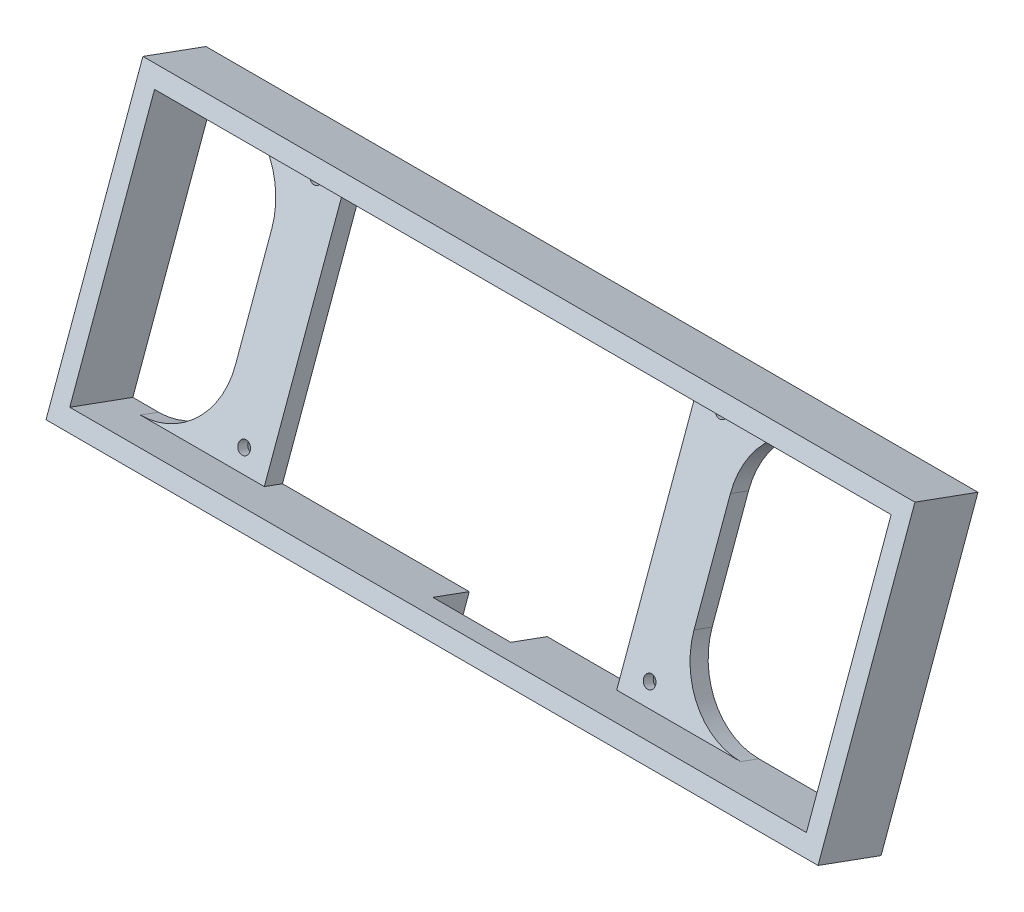
ISO-10303-21;
HEADER;
FILE_DESCRIPTION(('STEP AP214'),'2;1');
FILE_NAME('part.step','',(''),(''),'','','');
FILE_SCHEMA(('AUTOMOTIVE_DESIGN { 1 0 10303 214 1 1 1 1 }'));
ENDSEC;
DATA;
#1=APPLICATION_CONTEXT('core data for automotive mechanical design processes');
#2=APPLICATION_PROTOCOL_DEFINITION('international standard','automotive_design',2000,#1);
#3=PRODUCT_CONTEXT('',#1,'mechanical');
#4=PRODUCT('Part','Part','',(#3));
#5=PRODUCT_RELATED_PRODUCT_CATEGORY('part','',(#4));
#6=PRODUCT_DEFINITION_FORMATION('','',#4);
#7=PRODUCT_DEFINITION_CONTEXT('part definition',#1,'design');
#8=PRODUCT_DEFINITION('design','',#6,#7);
#9=PRODUCT_DEFINITION_SHAPE('','',#8);
#10=(LENGTH_UNIT() NAMED_UNIT(*) SI_UNIT(.MILLI.,.METRE.));
#11=(NAMED_UNIT(*) PLANE_ANGLE_UNIT() SI_UNIT($,.RADIAN.));
#12=(NAMED_UNIT(*) SI_UNIT($,.STERADIAN.) SOLID_ANGLE_UNIT());
#13=UNCERTAINTY_MEASURE_WITH_UNIT(LENGTH_MEASURE(1.E-05),#10,'distance_accuracy_value','');
#14=(GEOMETRIC_REPRESENTATION_CONTEXT(3) GLOBAL_UNCERTAINTY_ASSIGNED_CONTEXT((#13)) GLOBAL_UNIT_ASSIGNED_CONTEXT((#10,
#11,#12)) REPRESENTATION_CONTEXT('',''));
#15=CARTESIAN_POINT('',(0.,0.,0.));
#16=DIRECTION('',(0.,0.,1.));
#17=DIRECTION('',(1.,0.,0.));
#18=AXIS2_PLACEMENT_3D('',#15,#16,#17);
#19=CARTESIAN_POINT('',(-76.75,36.7497554802884,-15.9830526539522));
#20=DIRECTION('',(1.,0.,0.));
#21=DIRECTION('',(0.,0.,-1.));
#22=AXIS2_PLACEMENT_3D('',#19,#20,#21);
#23=PLANE('',#22);
#24=DIRECTION('',(0.,0.939692620785908,-0.342020143325669));
#25=VECTOR('',#24,1.);
#26=CARTESIAN_POINT('',(-76.75,36.7497554802884,-15.9830526539522));
#27=LINE('',#26,#25);
#28=CARTESIAN_POINT('',(-76.75,-14.9333386629365,2.82805522895957));
#29=VERTEX_POINT('',#28);
#30=CARTESIAN_POINT('',(-76.75,13.2574399606407,-7.43254907081052));
#31=VERTEX_POINT('',#30);
#32=EDGE_CURVE('E374',#29,#31,#27,.T.);
#33=ORIENTED_EDGE('',*,*,#32,.F.);
#34=DIRECTION('',(0.,-0.342020143325669,-0.939692620785908));
#35=VECTOR('',#34,1.);
#36=CARTESIAN_POINT('',(-76.75,-14.9333386629365,2.82805522895957));
#37=LINE('',#36,#35);
#38=CARTESIAN_POINT('',(-76.75,-13.0693288818116,7.94938001224278));
#39=VERTEX_POINT('',#38);
#40=EDGE_CURVE('E63',#29,#39,#37,.F.);
#41=ORIENTED_EDGE('',*,*,#40,.T.);
#42=DIRECTION('',(0.,-0.939692620785908,0.342020143325669));
#43=VECTOR('',#42,1.);
#44=CARTESIAN_POINT('',(-76.75,33.9153021574838,-9.15162715404071));
#45=LINE('',#44,#43);
#46=CARTESIAN_POINT('',(-76.75,15.1214497417656,-2.31122428752732));
#47=VERTEX_POINT('',#46);
#48=EDGE_CURVE('E315',#47,#39,#45,.T.);
#49=ORIENTED_EDGE('',*,*,#48,.F.);
#50=DIRECTION('',(0.,-0.342020143325669,-0.939692620785908));
#51=VECTOR('',#50,1.);
#52=CARTESIAN_POINT('',(-76.75,13.2574399606407,-7.43254907081052));
#53=LINE('',#52,#51);
#54=EDGE_CURVE('E55',#47,#31,#53,.T.);
#55=ORIENTED_EDGE('',*,*,#54,.T.);
#56=EDGE_LOOP('',(#33,#41,#49,#55));
#57=FACE_BOUND('',#56,.T.);
#58=ADVANCED_FACE('F40',(#57),#23,.F.);
#59=CARTESIAN_POINT('',(-61.75,36.7497554802884,-15.9830526539522));
#60=DIRECTION('',(-1.,0.,0.));
#61=DIRECTION('',(0.,0.,1.));
#62=AXIS2_PLACEMENT_3D('',#59,#60,#61);
#63=PLANE('',#62);
#64=DIRECTION('',(0.,-0.939692620785908,0.342020143325669));
#65=VECTOR('',#64,1.);
#66=CARTESIAN_POINT('',(-61.75,36.7497554802884,-15.9830526539522));
#67=LINE('',#66,#65);
#68=CARTESIAN_POINT('',(-61.75,32.0512923763589,-14.2729519373239));
#69=VERTEX_POINT('',#68);
#70=CARTESIAN_POINT('',(-61.75,-33.7271910786547,9.66845809547295));
#71=VERTEX_POINT('',#70);
#72=EDGE_CURVE('E371',#69,#71,#67,.T.);
#73=ORIENTED_EDGE('',*,*,#72,.F.);
#74=DIRECTION('',(0.,-0.342020143325669,-0.939692620785908));
#75=VECTOR('',#74,1.);
#76=CARTESIAN_POINT('',(-61.75,33.9153021574838,-9.15162715404071));
#77=LINE('',#76,#75);
#78=CARTESIAN_POINT('',(-61.75,33.9153021574838,-9.15162715404071));
#79=VERTEX_POINT('',#78);
#80=EDGE_CURVE('E282',#79,#69,#77,.T.);
#81=ORIENTED_EDGE('',*,*,#80,.F.);
#82=DIRECTION('',(0.,0.939692620785908,-0.342020143325669));
#83=VECTOR('',#82,1.);
#84=CARTESIAN_POINT('',(-61.75,-31.8631812975298,14.7897828787562));
#85=LINE('',#84,#83);
#86=CARTESIAN_POINT('',(-61.75,-31.8631812975298,14.7897828787562));
#87=VERTEX_POINT('',#86);
#88=EDGE_CURVE('E320',#87,#79,#85,.T.);
#89=ORIENTED_EDGE('',*,*,#88,.F.);
#90=DIRECTION('',(0.,-0.342020143325669,-0.939692620785908));
#91=VECTOR('',#90,1.);
#92=CARTESIAN_POINT('',(-61.75,-31.8631812975298,14.7897828787562));
#93=LINE('',#92,#91);
#94=EDGE_CURVE('E311',#87,#71,#93,.T.);
#95=ORIENTED_EDGE('',*,*,#94,.T.);
#96=EDGE_LOOP('',(#73,#81,#89,#95));
#97=FACE_BOUND('',#96,.T.);
#98=ADVANCED_FACE('F508',(#97),#63,.F.);
#99=CARTESIAN_POINT('',(37.75,36.7497554802884,-15.9830526539522));
#100=DIRECTION('',(1.,0.,0.));
#101=DIRECTION('',(0.,1.,0.));
#102=AXIS2_PLACEMENT_3D('',#99,#100,#101);
#103=PLANE('',#102);
#104=DIRECTION('',(0.,-0.342020143325669,-0.939692620785908));
#105=VECTOR('',#104,1.);
#106=CARTESIAN_POINT('',(37.75,33.9153021574838,-9.15162715404071));
#107=LINE('',#106,#105);
#108=CARTESIAN_POINT('',(37.75,33.9153021574838,-9.15162715404071));
#109=VERTEX_POINT('',#108);
#110=CARTESIAN_POINT('',(37.75,32.0512923763589,-14.2729519373239));
#111=VERTEX_POINT('',#110);
#112=EDGE_CURVE('E307',#109,#111,#107,.T.);
#113=ORIENTED_EDGE('',*,*,#112,.T.);
#114=DIRECTION('',(0.,0.939692620785908,-0.342020143325669));
#115=VECTOR('',#114,1.);
#116=CARTESIAN_POINT('',(37.75,36.7497554802884,-15.9830526539522));
#117=LINE('',#116,#115);
#118=CARTESIAN_POINT('',(37.75,-33.7271910786547,9.66845809547296));
#119=VERTEX_POINT('',#118);
#120=EDGE_CURVE('E354',#119,#111,#117,.T.);
#121=ORIENTED_EDGE('',*,*,#120,.F.);
#122=DIRECTION('',(0.,-0.342020143325669,-0.939692620785908));
#123=VECTOR('',#122,1.);
#124=CARTESIAN_POINT('',(37.75,-31.8631812975298,14.7897828787562));
#125=LINE('',#124,#123);
#126=CARTESIAN_POINT('',(37.75,-31.8631812975298,14.7897828787562));
#127=VERTEX_POINT('',#126);
#128=EDGE_CURVE('E305',#127,#119,#125,.T.);
#129=ORIENTED_EDGE('',*,*,#128,.F.);
#130=DIRECTION('',(0.,-0.939692620785908,0.342020143325669));
#131=VECTOR('',#130,1.);
#132=CARTESIAN_POINT('',(37.75,33.9153021574838,-9.15162715404071));
#133=LINE('',#132,#131);
#134=EDGE_CURVE('E301',#109,#127,#133,.T.);
#135=ORIENTED_EDGE('',*,*,#134,.F.);
#136=EDGE_LOOP('',(#113,#121,#129,#135));
#137=FACE_BOUND('',#136,.T.);
#138=ADVANCED_FACE('F480',(#137),#103,.F.);
#139=CARTESIAN_POINT('',(52.75,36.7497554802884,-15.9830526539522));
#140=DIRECTION('',(-1.,0.,0.));
#141=DIRECTION('',(0.,0.,1.));
#142=AXIS2_PLACEMENT_3D('',#139,#140,#141);
#143=PLANE('',#142);
#144=DIRECTION('',(0.,-0.939692620785908,0.342020143325669));
#145=VECTOR('',#144,1.);
#146=CARTESIAN_POINT('',(52.75,36.7497554802884,-15.9830526539522));
#147=LINE('',#146,#145);
#148=CARTESIAN_POINT('',(52.75,13.2574399606407,-7.43254907081052));
#149=VERTEX_POINT('',#148);
#150=CARTESIAN_POINT('',(52.75,-14.9333386629365,2.82805522895957));
#151=VERTEX_POINT('',#150);
#152=EDGE_CURVE('E362',#149,#151,#147,.T.);
#153=ORIENTED_EDGE('',*,*,#152,.F.);
#154=DIRECTION('',(0.,-0.342020143325669,-0.939692620785908));
#155=VECTOR('',#154,1.);
#156=CARTESIAN_POINT('',(52.75,13.2574399606407,-7.43254907081052));
#157=LINE('',#156,#155);
#158=CARTESIAN_POINT('',(52.75,15.1214497417656,-2.31122428752732));
#159=VERTEX_POINT('',#158);
#160=EDGE_CURVE('E414',#149,#159,#157,.F.);
#161=ORIENTED_EDGE('',*,*,#160,.T.);
#162=DIRECTION('',(0.,0.939692620785908,-0.342020143325669));
#163=VECTOR('',#162,1.);
#164=CARTESIAN_POINT('',(52.75,-31.8631812975298,14.7897828787562));
#165=LINE('',#164,#163);
#166=CARTESIAN_POINT('',(52.75,-13.0693288818116,7.94938001224276));
#167=VERTEX_POINT('',#166);
#168=EDGE_CURVE('E294',#167,#159,#165,.T.);
#169=ORIENTED_EDGE('',*,*,#168,.F.);
#170=DIRECTION('',(0.,-0.342020143325669,-0.939692620785908));
#171=VECTOR('',#170,1.);
#172=CARTESIAN_POINT('',(52.75,-14.9333386629365,2.82805522895957));
#173=LINE('',#172,#171);
#174=EDGE_CURVE('E416',#167,#151,#173,.T.);
#175=ORIENTED_EDGE('',*,*,#174,.T.);
#176=EDGE_LOOP('',(#153,#161,#169,#175));
#177=FACE_BOUND('',#176,.T.);
#178=ADVANCED_FACE('F471',(#177),#143,.F.);
#179=CARTESIAN_POINT('',(13.,-40.6055678757603,-9.22972683707519));
#180=DIRECTION('',(1.,0.,0.));
#181=DIRECTION('',(0.,1.,0.));
#182=AXIS2_PLACEMENT_3D('',#179,#180,#181);
#183=PLANE('',#182);
#184=DIRECTION('',(0.,0.939692620785908,-0.34202014332567));
#185=VECTOR('',#184,1.);
#186=CARTESIAN_POINT('',(13.,-29.9820705092386,19.9580922930787));
#187=LINE('',#186,#185);
#188=CARTESIAN_POINT('',(13.,-34.6805336131681,21.668193009707));
#189=VERTEX_POINT('',#188);
#190=CARTESIAN_POINT('',(13.,-29.9820705092386,19.9580922930787));
#191=VERTEX_POINT('',#190);
#192=EDGE_CURVE('E277',#189,#191,#187,.T.);
#193=ORIENTED_EDGE('',*,*,#192,.T.);
#194=DIRECTION('',(0.,0.342020143325669,0.939692620785908));
#195=VECTOR('',#194,1.);
#196=CARTESIAN_POINT('',(13.,-40.6055678757603,-9.22972683707519));
#197=LINE('',#196,#195);
#198=CARTESIAN_POINT('',(13.,-33.7271910786547,9.66845809547295));
#199=VERTEX_POINT('',#198);
#200=EDGE_CURVE('E336',#199,#191,#197,.T.);
#201=ORIENTED_EDGE('',*,*,#200,.F.);
#202=DIRECTION('',(0.,0.939692620785908,-0.342020143325669));
#203=VECTOR('',#202,1.);
#204=CARTESIAN_POINT('',(13.,-38.4256541825842,11.3785588121013));
#205=LINE('',#204,#203);
#206=CARTESIAN_POINT('',(13.,-38.4256541825842,11.3785588121013));
#207=VERTEX_POINT('',#206);
#208=EDGE_CURVE('E247',#207,#199,#205,.T.);
#209=ORIENTED_EDGE('',*,*,#208,.F.);
#210=DIRECTION('',(0.,0.342020143325669,0.939692620785908));
#211=VECTOR('',#210,1.);
#212=CARTESIAN_POINT('',(13.,-45.3040309796898,-7.51962612044686));
#213=LINE('',#212,#211);
#214=EDGE_CURVE('E339',#207,#189,#213,.T.);
#215=ORIENTED_EDGE('',*,*,#214,.T.);
#216=EDGE_LOOP('',(#193,#201,#209,#215));
#217=FACE_BOUND('',#216,.T.);
#218=ADVANCED_FACE('F597',(#217),#183,.F.);
#219=CARTESIAN_POINT('',(-8.99999999999995,-40.6055678757603,-9.22972683707519));
#220=DIRECTION('',(-1.,0.,0.));
#221=DIRECTION('',(0.,0.,1.));
#222=AXIS2_PLACEMENT_3D('',#219,#220,#221);
#223=PLANE('',#222);
#224=DIRECTION('',(0.,-0.939692620785908,0.34202014332567));
#225=VECTOR('',#224,1.);
#226=CARTESIAN_POINT('',(-8.99999999999995,-29.9820705092386,19.9580922930787));
#227=LINE('',#226,#225);
#228=CARTESIAN_POINT('',(-8.99999999999995,-29.9820705092386,19.9580922930787));
#229=VERTEX_POINT('',#228);
#230=CARTESIAN_POINT('',(-8.99999999999995,-34.6805336131681,21.668193009707));
#231=VERTEX_POINT('',#230);
#232=EDGE_CURVE('E231',#229,#231,#227,.T.);
#233=ORIENTED_EDGE('',*,*,#232,.T.);
#234=DIRECTION('',(0.,0.342020143325669,0.939692620785908));
#235=VECTOR('',#234,1.);
#236=CARTESIAN_POINT('',(-8.99999999999995,-45.3040309796898,-7.51962612044686));
#237=LINE('',#236,#235);
#238=CARTESIAN_POINT('',(-8.99999999999995,-38.4256541825842,11.3785588121013));
#239=VERTEX_POINT('',#238);
#240=EDGE_CURVE('E309',#239,#231,#237,.T.);
#241=ORIENTED_EDGE('',*,*,#240,.F.);
#242=DIRECTION('',(0.,-0.939692620785908,0.342020143325669));
#243=VECTOR('',#242,1.);
#244=CARTESIAN_POINT('',(-8.99999999999998,-33.7271910786547,9.66845809547295));
#245=LINE('',#244,#243);
#246=CARTESIAN_POINT('',(-8.99999999999998,-33.7271910786547,9.66845809547295));
#247=VERTEX_POINT('',#246);
#248=EDGE_CURVE('E246',#247,#239,#245,.T.);
#249=ORIENTED_EDGE('',*,*,#248,.F.);
#250=DIRECTION('',(0.,0.342020143325669,0.939692620785908));
#251=VECTOR('',#250,1.);
#252=CARTESIAN_POINT('',(-8.99999999999995,-40.6055678757603,-9.22972683707519));
#253=LINE('',#252,#251);
#254=EDGE_CURVE('E333',#247,#229,#253,.T.);
#255=ORIENTED_EDGE('',*,*,#254,.T.);
#256=EDGE_LOOP('',(#233,#241,#249,#255));
#257=FACE_BOUND('',#256,.T.);
#258=ADVANCED_FACE('F497',(#257),#223,.F.);
#259=CARTESIAN_POINT('',(-104.,38.5325740923803,3.53422322656905));
#260=DIRECTION('',(0.,-0.939692620785908,0.342020143325669));
#261=DIRECTION('',(0.,-0.342020143325669,-0.939692620785908));
#262=AXIS2_PLACEMENT_3D('',#259,#260,#261);
#263=PLANE('',#262);
#264=DIRECTION('',(-1.,0.,0.));
#265=VECTOR('',#264,1.);
#266=CARTESIAN_POINT('',(52.75,33.9153021574838,-9.15162715404071));
#267=LINE('',#266,#265);
#268=CARTESIAN_POINT('',(72.75,33.9153021574838,-9.15162715404071));
#269=VERTEX_POINT('',#268);
#270=EDGE_CURVE('E299',#269,#109,#267,.T.);
#271=ORIENTED_EDGE('',*,*,#270,.F.);
#272=DIRECTION('',(0.,-0.342020143325669,-0.939692620785908));
#273=VECTOR('',#272,1.);
#274=CARTESIAN_POINT('',(72.75,38.5325740923803,3.53422322656905));
#275=LINE('',#274,#273);
#276=CARTESIAN_POINT('',(72.75,32.0512923763589,-14.2729519373239));
#277=VERTEX_POINT('',#276);
#278=EDGE_CURVE('E424',#269,#277,#275,.T.);
#279=ORIENTED_EDGE('',*,*,#278,.T.);
#280=DIRECTION('',(-1.,0.,0.));
#281=VECTOR('',#280,1.);
#282=CARTESIAN_POINT('',(104.,32.0512923763589,-14.2729519373239));
#283=LINE('',#282,#281);
#284=CARTESIAN_POINT('',(104.,32.0512923763589,-14.2729519373239));
#285=VERTEX_POINT('',#284);
#286=EDGE_CURVE('E224',#285,#277,#283,.T.);
#287=ORIENTED_EDGE('',*,*,#286,.F.);
#288=DIRECTION('',(0.,-0.342020143325669,-0.939692620785908));
#289=VECTOR('',#288,1.);
#290=CARTESIAN_POINT('',(104.,38.5325740923803,3.53422322656905));
#291=LINE('',#290,#289);
#292=CARTESIAN_POINT('',(104.,38.5325740923803,3.53422322656905));
#293=VERTEX_POINT('',#292);
#294=EDGE_CURVE('E395',#293,#285,#291,.T.);
#295=ORIENTED_EDGE('',*,*,#294,.F.);
#296=DIRECTION('',(-1.,0.,0.));
#297=VECTOR('',#296,1.);
#298=CARTESIAN_POINT('',(-104.,38.5325740923803,3.53422322656905));
#299=LINE('',#298,#297);
#300=CARTESIAN_POINT('',(-104.,38.5325740923803,3.53422322656905));
#301=VERTEX_POINT('',#300);
#302=EDGE_CURVE('E388',#293,#301,#299,.T.);
#303=ORIENTED_EDGE('',*,*,#302,.T.);
#304=DIRECTION('',(0.,-0.342020143325669,-0.939692620785908));
#305=VECTOR('',#304,1.);
#306=CARTESIAN_POINT('',(-104.,38.5325740923803,3.53422322656905));
#307=LINE('',#306,#305);
#308=CARTESIAN_POINT('',(-104.,32.0512923763589,-14.2729519373239));
#309=VERTEX_POINT('',#308);
#310=EDGE_CURVE('E213',#301,#309,#307,.T.);
#311=ORIENTED_EDGE('',*,*,#310,.T.);
#312=DIRECTION('',(-1.,0.,0.));
#313=VECTOR('',#312,1.);
#314=CARTESIAN_POINT('',(-96.75,32.0512923763589,-14.2729519373239));
#315=LINE('',#314,#313);
#316=CARTESIAN_POINT('',(-96.75,32.0512923763589,-14.2729519373239));
#317=VERTEX_POINT('',#316);
#318=EDGE_CURVE('E230',#317,#309,#315,.T.);
#319=ORIENTED_EDGE('',*,*,#318,.F.);
#320=DIRECTION('',(0.,-0.342020143325669,-0.939692620785908));
#321=VECTOR('',#320,1.);
#322=CARTESIAN_POINT('',(-96.75,38.5325740923803,3.53422322656905));
#323=LINE('',#322,#321);
#324=CARTESIAN_POINT('',(-96.75,33.9153021574838,-9.15162715404071));
#325=VERTEX_POINT('',#324);
#326=EDGE_CURVE('E421',#317,#325,#323,.F.);
#327=ORIENTED_EDGE('',*,*,#326,.T.);
#328=DIRECTION('',(-1.,0.,0.));
#329=VECTOR('',#328,1.);
#330=CARTESIAN_POINT('',(-61.75,33.9153021574838,-9.15162715404071));
#331=LINE('',#330,#329);
#332=EDGE_CURVE('E318',#79,#325,#331,.T.);
#333=ORIENTED_EDGE('',*,*,#332,.F.);
#334=ORIENTED_EDGE('',*,*,#80,.T.);
#335=DIRECTION('',(-1.,0.,0.));
#336=VECTOR('',#335,1.);
#337=CARTESIAN_POINT('',(37.75,32.0512923763589,-14.2729519373239));
#338=LINE('',#337,#336);
#339=EDGE_CURVE('E250',#111,#69,#338,.T.);
#340=ORIENTED_EDGE('',*,*,#339,.F.);
#341=ORIENTED_EDGE('',*,*,#112,.F.);
#342=EDGE_LOOP('',(#271,#279,#287,#295,#303,#311,#319,#327,#333,#334,#340,#341));
#343=FACE_BOUND('',#342,.T.);
#344=ADVANCED_FACE('F444',(#343),#263,.T.);
#345=CARTESIAN_POINT('',(-104.,-27.2459093626332,27.4756332593659));
#346=DIRECTION('',(0.,0.939692620785908,-0.342020143325669));
#347=DIRECTION('',(0.,0.342020143325669,0.939692620785908));
#348=AXIS2_PLACEMENT_3D('',#345,#346,#347);
#349=PLANE('',#348);
#350=DIRECTION('',(0.,-0.342020143325669,-0.939692620785908));
#351=VECTOR('',#350,1.);
#352=CARTESIAN_POINT('',(104.,-27.2459093626332,27.4756332593659));
#353=LINE('',#352,#351);
#354=CARTESIAN_POINT('',(104.,-27.2459093626332,27.4756332593659));
#355=VERTEX_POINT('',#354);
#356=CARTESIAN_POINT('',(104.,-33.7271910786547,9.66845809547295));
#357=VERTEX_POINT('',#356);
#358=EDGE_CURVE('E214',#355,#357,#353,.T.);
#359=ORIENTED_EDGE('',*,*,#358,.T.);
#360=DIRECTION('',(1.,0.,0.));
#361=VECTOR('',#360,1.);
#362=CARTESIAN_POINT('',(72.75,-33.7271910786547,9.66845809547297));
#363=LINE('',#362,#361);
#364=CARTESIAN_POINT('',(72.75,-33.7271910786547,9.66845809547295));
#365=VERTEX_POINT('',#364);
#366=EDGE_CURVE('E264',#365,#357,#363,.T.);
#367=ORIENTED_EDGE('',*,*,#366,.F.);
#368=DIRECTION('',(0.,-0.342020143325669,-0.939692620785908));
#369=VECTOR('',#368,1.);
#370=CARTESIAN_POINT('',(72.75,-27.2459093626332,27.4756332593659));
#371=LINE('',#370,#369);
#372=CARTESIAN_POINT('',(72.75,-31.8631812975298,14.7897828787562));
#373=VERTEX_POINT('',#372);
#374=EDGE_CURVE('E418',#365,#373,#371,.F.);
#375=ORIENTED_EDGE('',*,*,#374,.T.);
#376=DIRECTION('',(1.,0.,0.));
#377=VECTOR('',#376,1.);
#378=CARTESIAN_POINT('',(37.75,-31.8631812975298,14.7897828787562));
#379=LINE('',#378,#377);
#380=EDGE_CURVE('E303',#127,#373,#379,.T.);
#381=ORIENTED_EDGE('',*,*,#380,.F.);
#382=ORIENTED_EDGE('',*,*,#128,.T.);
#383=DIRECTION('',(1.,0.,0.));
#384=VECTOR('',#383,1.);
#385=CARTESIAN_POINT('',(13.0000000000001,-33.7271910786547,9.66845809547297));
#386=LINE('',#385,#384);
#387=EDGE_CURVE('E243',#199,#119,#386,.T.);
#388=ORIENTED_EDGE('',*,*,#387,.F.);
#389=ORIENTED_EDGE('',*,*,#200,.T.);
#390=DIRECTION('',(-1.,0.,0.));
#391=VECTOR('',#390,1.);
#392=CARTESIAN_POINT('',(-8.99999999999995,-29.9820705092386,19.9580922930787));
#393=LINE('',#392,#391);
#394=EDGE_CURVE('E279',#191,#229,#393,.T.);
#395=ORIENTED_EDGE('',*,*,#394,.T.);
#396=ORIENTED_EDGE('',*,*,#254,.F.);
#397=DIRECTION('',(1.,0.,0.));
#398=VECTOR('',#397,1.);
#399=CARTESIAN_POINT('',(-61.75,-33.7271910786547,9.66845809547297));
#400=LINE('',#399,#398);
#401=EDGE_CURVE('E270',#71,#247,#400,.T.);
#402=ORIENTED_EDGE('',*,*,#401,.F.);
#403=ORIENTED_EDGE('',*,*,#94,.F.);
#404=DIRECTION('',(1.,0.,0.));
#405=VECTOR('',#404,1.);
#406=CARTESIAN_POINT('',(-76.75,-31.8631812975298,14.7897828787562));
#407=LINE('',#406,#405);
#408=CARTESIAN_POINT('',(-96.75,-31.8631812975298,14.7897828787562));
#409=VERTEX_POINT('',#408);
#410=EDGE_CURVE('E313',#409,#87,#407,.T.);
#411=ORIENTED_EDGE('',*,*,#410,.F.);
#412=DIRECTION('',(0.,-0.342020143325669,-0.939692620785908));
#413=VECTOR('',#412,1.);
#414=CARTESIAN_POINT('',(-96.75,-27.2459093626332,27.4756332593659));
#415=LINE('',#414,#413);
#416=CARTESIAN_POINT('',(-96.75,-33.7271910786547,9.66845809547297));
#417=VERTEX_POINT('',#416);
#418=EDGE_CURVE('E220',#409,#417,#415,.T.);
#419=ORIENTED_EDGE('',*,*,#418,.T.);
#420=DIRECTION('',(1.,0.,0.));
#421=VECTOR('',#420,1.);
#422=CARTESIAN_POINT('',(-104.,-33.7271910786547,9.66845809547297));
#423=LINE('',#422,#421);
#424=CARTESIAN_POINT('',(-104.,-33.7271910786547,9.66845809547295));
#425=VERTEX_POINT('',#424);
#426=EDGE_CURVE('E217',#425,#417,#423,.T.);
#427=ORIENTED_EDGE('',*,*,#426,.F.);
#428=DIRECTION('',(0.,-0.342020143325669,-0.939692620785908));
#429=VECTOR('',#428,1.);
#430=CARTESIAN_POINT('',(-104.,-27.2459093626332,27.4756332593659));
#431=LINE('',#430,#429);
#432=CARTESIAN_POINT('',(-104.,-27.2459093626332,27.4756332593659));
#433=VERTEX_POINT('',#432);
#434=EDGE_CURVE('E202',#433,#425,#431,.T.);
#435=ORIENTED_EDGE('',*,*,#434,.F.);
#436=DIRECTION('',(1.,0.,0.));
#437=VECTOR('',#436,1.);
#438=CARTESIAN_POINT('',(-104.,-27.2459093626332,27.4756332593659));
#439=LINE('',#438,#437);
#440=EDGE_CURVE('E391',#433,#355,#439,.T.);
#441=ORIENTED_EDGE('',*,*,#440,.T.);
#442=EDGE_LOOP('',(#359,#367,#375,#381,#382,#388,#389,#395,#396,#402,#403,#411,#419,#427,#435,#441));
#443=FACE_BOUND('',#442,.T.);
#444=ADVANCED_FACE('F218',(#443),#349,.T.);
#445=CARTESIAN_POINT('',(0.,5.64333236487355,15.5049282429675));
#446=DIRECTION('',(0.,0.342020143325669,0.939692620785908));
#447=DIRECTION('',(0.,-0.939692620785908,0.342020143325669));
#448=AXIS2_PLACEMENT_3D('',#445,#446,#447);
#449=PLANE('',#448);
#450=DIRECTION('',(0.,0.939692620785908,-0.34202014332567));
#451=VECTOR('',#450,1.);
#452=CARTESIAN_POINT('',(104.,-27.2459093626332,27.4756332593659));
#453=LINE('',#452,#451);
#454=EDGE_CURVE('E368',#355,#293,#453,.T.);
#455=ORIENTED_EDGE('',*,*,#454,.F.);
#456=ORIENTED_EDGE('',*,*,#440,.F.);
#457=DIRECTION('',(0.,-0.939692620785908,0.34202014332567));
#458=VECTOR('',#457,1.);
#459=CARTESIAN_POINT('',(-104.,-27.2459093626332,27.4756332593659));
#460=LINE('',#459,#458);
#461=EDGE_CURVE('E210',#301,#433,#460,.T.);
#462=ORIENTED_EDGE('',*,*,#461,.F.);
#463=ORIENTED_EDGE('',*,*,#302,.F.);
#464=EDGE_LOOP('',(#455,#456,#462,#463));
#465=FACE_BOUND('',#464,.T.);
#466=DIRECTION('',(1.,0.,0.));
#467=VECTOR('',#466,1.);
#468=CARTESIAN_POINT('',(-109.,-31.9443724665628,29.1857339759943));
#469=LINE('',#468,#467);
#470=CARTESIAN_POINT('',(-109.,-31.9443724665628,29.1857339759943));
#471=VERTEX_POINT('',#470);
#472=CARTESIAN_POINT('',(109.,-31.9443724665628,29.1857339759943));
#473=VERTEX_POINT('',#472);
#474=EDGE_CURVE('E404',#471,#473,#469,.T.);
#475=ORIENTED_EDGE('',*,*,#474,.T.);
#476=DIRECTION('',(0.,0.939692620785908,-0.342020143325669));
#477=VECTOR('',#476,1.);
#478=CARTESIAN_POINT('',(109.,43.2310371963099,1.82412250994071));
#479=LINE('',#478,#477);
#480=CARTESIAN_POINT('',(109.,43.2310371963099,1.82412250994071));
#481=VERTEX_POINT('',#480);
#482=EDGE_CURVE('E397',#473,#481,#479,.T.);
#483=ORIENTED_EDGE('',*,*,#482,.T.);
#484=DIRECTION('',(-1.,0.,0.));
#485=VECTOR('',#484,1.);
#486=CARTESIAN_POINT('',(-109.,43.2310371963099,1.82412250994071));
#487=LINE('',#486,#485);
#488=CARTESIAN_POINT('',(-109.,43.2310371963099,1.82412250994071));
#489=VERTEX_POINT('',#488);
#490=EDGE_CURVE('E400',#481,#489,#487,.T.);
#491=ORIENTED_EDGE('',*,*,#490,.T.);
#492=DIRECTION('',(0.,-0.939692620785908,0.342020143325669));
#493=VECTOR('',#492,1.);
#494=CARTESIAN_POINT('',(-109.,43.2310371963099,1.82412250994071));
#495=LINE('',#494,#493);
#496=EDGE_CURVE('E402',#489,#471,#495,.T.);
#497=ORIENTED_EDGE('',*,*,#496,.T.);
#498=EDGE_LOOP('',(#475,#483,#491,#497));
#499=FACE_BOUND('',#498,.T.);
#500=ADVANCED_FACE('F449',(#465,#499),#449,.T.);
#501=CARTESIAN_POINT('',(109.,43.2310371963099,1.82412250994071));
#502=DIRECTION('',(-1.,0.,0.));
#503=DIRECTION('',(0.,0.,1.));
#504=AXIS2_PLACEMENT_3D('',#501,#502,#503);
#505=PLANE('',#504);
#506=DIRECTION('',(0.,-0.342020143325669,-0.939692620785908));
#507=VECTOR('',#506,1.);
#508=CARTESIAN_POINT('',(109.,-31.9443724665628,29.1857339759943));
#509=LINE('',#508,#507);
#510=CARTESIAN_POINT('',(109.,-38.4256541825842,11.3785588121013));
#511=VERTEX_POINT('',#510);
#512=EDGE_CURVE('E406',#473,#511,#509,.T.);
#513=ORIENTED_EDGE('',*,*,#512,.T.);
#514=DIRECTION('',(0.,-0.939692620785908,0.342020143325669));
#515=VECTOR('',#514,1.);
#516=CARTESIAN_POINT('',(109.,36.7497554802884,-15.9830526539523));
#517=LINE('',#516,#515);
#518=CARTESIAN_POINT('',(109.,36.7497554802884,-15.9830526539523));
#519=VERTEX_POINT('',#518);
#520=EDGE_CURVE('E258',#519,#511,#517,.T.);
#521=ORIENTED_EDGE('',*,*,#520,.F.);
#522=DIRECTION('',(0.,-0.342020143325669,-0.939692620785908));
#523=VECTOR('',#522,1.);
#524=CARTESIAN_POINT('',(109.,43.2310371963099,1.82412250994071));
#525=LINE('',#524,#523);
#526=EDGE_CURVE('E412',#481,#519,#525,.T.);
#527=ORIENTED_EDGE('',*,*,#526,.F.);
#528=ORIENTED_EDGE('',*,*,#482,.F.);
#529=EDGE_LOOP('',(#513,#521,#527,#528));
#530=FACE_BOUND('',#529,.T.);
#531=ADVANCED_FACE('F537',(#530),#505,.F.);
#532=CARTESIAN_POINT('',(-109.,43.2310371963099,1.82412250994071));
#533=DIRECTION('',(0.,-0.939692620785908,0.342020143325669));
#534=DIRECTION('',(0.,-0.342020143325669,-0.939692620785908));
#535=AXIS2_PLACEMENT_3D('',#532,#533,#534);
#536=PLANE('',#535);
#537=DIRECTION('',(1.,0.,0.));
#538=VECTOR('',#537,1.);
#539=CARTESIAN_POINT('',(52.75,36.7497554802884,-15.9830526539522));
#540=LINE('',#539,#538);
#541=CARTESIAN_POINT('',(-109.,36.7497554802884,-15.9830526539523));
#542=VERTEX_POINT('',#541);
#543=EDGE_CURVE('E359',#542,#519,#540,.T.);
#544=ORIENTED_EDGE('',*,*,#543,.F.);
#545=DIRECTION('',(0.,-0.342020143325669,-0.939692620785908));
#546=VECTOR('',#545,1.);
#547=CARTESIAN_POINT('',(-109.,43.2310371963099,1.82412250994071));
#548=LINE('',#547,#546);
#549=EDGE_CURVE('E410',#489,#542,#548,.T.);
#550=ORIENTED_EDGE('',*,*,#549,.F.);
#551=ORIENTED_EDGE('',*,*,#490,.F.);
#552=ORIENTED_EDGE('',*,*,#526,.T.);
#553=EDGE_LOOP('',(#544,#550,#551,#552));
#554=FACE_BOUND('',#553,.T.);
#555=ADVANCED_FACE('F543',(#554),#536,.F.);
#556=CARTESIAN_POINT('',(-109.,43.2310371963099,1.82412250994071));
#557=DIRECTION('',(1.,0.,0.));
#558=DIRECTION('',(0.,0.,-1.));
#559=AXIS2_PLACEMENT_3D('',#556,#557,#558);
#560=PLANE('',#559);
#561=ORIENTED_EDGE('',*,*,#549,.T.);
#562=DIRECTION('',(0.,0.939692620785908,-0.342020143325669));
#563=VECTOR('',#562,1.);
#564=CARTESIAN_POINT('',(-109.,-38.4256541825842,11.3785588121013));
#565=LINE('',#564,#563);
#566=CARTESIAN_POINT('',(-109.,-38.4256541825842,11.3785588121013));
#567=VERTEX_POINT('',#566);
#568=EDGE_CURVE('E239',#567,#542,#565,.T.);
#569=ORIENTED_EDGE('',*,*,#568,.F.);
#570=DIRECTION('',(0.,-0.342020143325669,-0.939692620785908));
#571=VECTOR('',#570,1.);
#572=CARTESIAN_POINT('',(-109.,-31.9443724665628,29.1857339759943));
#573=LINE('',#572,#571);
#574=EDGE_CURVE('E408',#471,#567,#573,.T.);
#575=ORIENTED_EDGE('',*,*,#574,.F.);
#576=ORIENTED_EDGE('',*,*,#496,.F.);
#577=EDGE_LOOP('',(#561,#569,#575,#576));
#578=FACE_BOUND('',#577,.T.);
#579=ADVANCED_FACE('F540',(#578),#560,.F.);
#580=CARTESIAN_POINT('',(-109.,-31.9443724665628,29.1857339759943));
#581=DIRECTION('',(0.,0.939692620785908,-0.342020143325669));
#582=DIRECTION('',(0.,0.342020143325669,0.939692620785908));
#583=AXIS2_PLACEMENT_3D('',#580,#581,#582);
#584=PLANE('',#583);
#585=DIRECTION('',(-1.,0.,0.));
#586=VECTOR('',#585,1.);
#587=CARTESIAN_POINT('',(-61.75,-38.4256541825842,11.3785588121013));
#588=LINE('',#587,#586);
#589=EDGE_CURVE('E335',#239,#567,#588,.T.);
#590=ORIENTED_EDGE('',*,*,#589,.F.);
#591=ORIENTED_EDGE('',*,*,#240,.T.);
#592=DIRECTION('',(1.,0.,0.));
#593=VECTOR('',#592,1.);
#594=CARTESIAN_POINT('',(-8.99999999999995,-34.6805336131681,21.668193009707));
#595=LINE('',#594,#593);
#596=EDGE_CURVE('E233',#231,#189,#595,.T.);
#597=ORIENTED_EDGE('',*,*,#596,.T.);
#598=ORIENTED_EDGE('',*,*,#214,.F.);
#599=DIRECTION('',(-1.,0.,0.));
#600=VECTOR('',#599,1.);
#601=CARTESIAN_POINT('',(52.75,-38.4256541825842,11.3785588121013));
#602=LINE('',#601,#600);
#603=EDGE_CURVE('E365',#511,#207,#602,.T.);
#604=ORIENTED_EDGE('',*,*,#603,.F.);
#605=ORIENTED_EDGE('',*,*,#512,.F.);
#606=ORIENTED_EDGE('',*,*,#474,.F.);
#607=ORIENTED_EDGE('',*,*,#574,.T.);
#608=EDGE_LOOP('',(#590,#591,#597,#598,#604,#605,#606,#607));
#609=FACE_BOUND('',#608,.T.);
#610=ADVANCED_FACE('F501',(#609),#584,.F.);
#611=CARTESIAN_POINT('',(104.,-27.2459093626332,27.4756332593659));
#612=DIRECTION('',(-1.,0.,0.));
#613=DIRECTION('',(0.,0.,1.));
#614=AXIS2_PLACEMENT_3D('',#611,#612,#613);
#615=PLANE('',#614);
#616=ORIENTED_EDGE('',*,*,#294,.T.);
#617=DIRECTION('',(0.,0.939692620785908,-0.342020143325669));
#618=VECTOR('',#617,1.);
#619=CARTESIAN_POINT('',(104.,-33.7271910786547,9.66845809547295));
#620=LINE('',#619,#618);
#621=EDGE_CURVE('E267',#357,#285,#620,.T.);
#622=ORIENTED_EDGE('',*,*,#621,.F.);
#623=ORIENTED_EDGE('',*,*,#358,.F.);
#624=ORIENTED_EDGE('',*,*,#454,.T.);
#625=EDGE_LOOP('',(#616,#622,#623,#624));
#626=FACE_BOUND('',#625,.T.);
#627=ADVANCED_FACE('F455',(#626),#615,.T.);
#628=CARTESIAN_POINT('',(-104.,-27.2459093626332,27.4756332593659));
#629=DIRECTION('',(1.,0.,0.));
#630=DIRECTION('',(0.,0.,-1.));
#631=AXIS2_PLACEMENT_3D('',#628,#629,#630);
#632=PLANE('',#631);
#633=ORIENTED_EDGE('',*,*,#434,.T.);
#634=DIRECTION('',(0.,-0.939692620785908,0.342020143325669));
#635=VECTOR('',#634,1.);
#636=CARTESIAN_POINT('',(-104.,32.0512923763589,-14.2729519373239));
#637=LINE('',#636,#635);
#638=EDGE_CURVE('E207',#309,#425,#637,.T.);
#639=ORIENTED_EDGE('',*,*,#638,.F.);
#640=ORIENTED_EDGE('',*,*,#310,.F.);
#641=ORIENTED_EDGE('',*,*,#461,.T.);
#642=EDGE_LOOP('',(#633,#639,#640,#641));
#643=FACE_BOUND('',#642,.T.);
#644=ADVANCED_FACE('F204',(#643),#632,.T.);
#645=CARTESIAN_POINT('',(-69.25,27.1179061172329,-12.4773461848641));
#646=DIRECTION('',(0.,0.342020143325669,0.939692620785908));
#647=DIRECTION('',(0.,-0.939692620785908,0.342020143325669));
#648=AXIS2_PLACEMENT_3D('',#645,#646,#647);
#649=CYLINDRICAL_SURFACE('',#648,3.25000000000001);
#650=CARTESIAN_POINT('',(-69.25,27.1179061172329,-12.4773461848641));
#651=DIRECTION('',(0.,-0.342020143325669,-0.939692620785908));
#652=DIRECTION('',(0.,0.939692620785908,-0.342020143325669));
#653=AXIS2_PLACEMENT_3D('',#650,#651,#652);
#654=CIRCLE('',#653,3.25000000000001);
#655=CARTESIAN_POINT('',(-69.25,30.1719071347871,-13.5889116506726));
#656=VERTEX_POINT('',#655);
#657=EDGE_CURVE('E376',#656,#656,#654,.T.);
#658=ORIENTED_EDGE('',*,*,#657,.T.);
#659=EDGE_LOOP('',(#658));
#660=FACE_BOUND('',#659,.T.);
#661=CARTESIAN_POINT('',(-69.25,27.9558554683808,-10.1750992639387));
#662=DIRECTION('',(0.,-0.342020143325669,-0.939692620785908));
#663=DIRECTION('',(0.,0.939692620785908,-0.342020143325669));
#664=AXIS2_PLACEMENT_3D('',#661,#662,#663);
#665=CIRCLE('',#664,3.25000000000001);
#666=CARTESIAN_POINT('',(-69.25,31.009856485935,-11.2866647297471));
#667=VERTEX_POINT('',#666);
#668=EDGE_CURVE('E377',#667,#667,#665,.T.);
#669=ORIENTED_EDGE('',*,*,#668,.F.);
#670=EDGE_LOOP('',(#669));
#671=FACE_BOUND('',#670,.T.);
#672=ADVANCED_FACE('F519',(#660,#671),#649,.F.);
#673=CARTESIAN_POINT('',(-69.25,-28.7938048195287,7.87285234301319));
#674=DIRECTION('',(0.,0.342020143325669,0.939692620785908));
#675=DIRECTION('',(0.,-0.939692620785908,0.342020143325669));
#676=AXIS2_PLACEMENT_3D('',#673,#674,#675);
#677=CYLINDRICAL_SURFACE('',#676,3.25000000000001);
#678=CARTESIAN_POINT('',(-69.25,-28.7938048195287,7.87285234301319));
#679=DIRECTION('',(0.,-0.342020143325669,-0.939692620785908));
#680=DIRECTION('',(0.,0.939692620785908,-0.342020143325669));
#681=AXIS2_PLACEMENT_3D('',#678,#679,#680);
#682=CIRCLE('',#681,3.25000000000001);
#683=CARTESIAN_POINT('',(-69.25,-25.7398038019744,6.76128687720476));
#684=VERTEX_POINT('',#683);
#685=EDGE_CURVE('E380',#684,#684,#682,.T.);
#686=ORIENTED_EDGE('',*,*,#685,.T.);
#687=EDGE_LOOP('',(#686));
#688=FACE_BOUND('',#687,.T.);
#689=CARTESIAN_POINT('',(-69.25,-27.9558554683808,10.1750992639387));
#690=DIRECTION('',(0.,-0.342020143325669,-0.939692620785908));
#691=DIRECTION('',(0.,0.939692620785908,-0.342020143325669));
#692=AXIS2_PLACEMENT_3D('',#689,#690,#691);
#693=CIRCLE('',#692,3.25000000000001);
#694=CARTESIAN_POINT('',(-69.25,-24.9018544508266,9.06353379813024));
#695=VERTEX_POINT('',#694);
#696=EDGE_CURVE('E350',#695,#695,#693,.T.);
#697=ORIENTED_EDGE('',*,*,#696,.F.);
#698=EDGE_LOOP('',(#697));
#699=FACE_BOUND('',#698,.T.);
#700=ADVANCED_FACE('F522',(#688,#699),#677,.F.);
#701=CARTESIAN_POINT('',(0.,-0.83794935114789,-2.30224692092547));
#702=DIRECTION('',(0.,-0.342020143325669,-0.939692620785908));
#703=DIRECTION('',(0.,0.939692620785908,-0.342020143325669));
#704=AXIS2_PLACEMENT_3D('',#701,#702,#703);
#705=PLANE('',#704);
#706=CARTESIAN_POINT('',(-96.75,-14.9333386629365,2.82805522895958));
#707=DIRECTION('',(0.,-0.342020143325669,-0.939692620785908));
#708=DIRECTION('',(0.,0.939692620785908,-0.342020143325669));
#709=AXIS2_PLACEMENT_3D('',#706,#707,#708);
#710=CIRCLE('',#709,20.);
#711=EDGE_CURVE('E223',#417,#29,#710,.F.);
#712=ORIENTED_EDGE('',*,*,#711,.T.);
#713=ORIENTED_EDGE('',*,*,#32,.T.);
#714=CARTESIAN_POINT('',(-96.75,13.2574399606407,-7.43254907081051));
#715=DIRECTION('',(0.,-0.342020143325669,-0.939692620785908));
#716=DIRECTION('',(0.,0.939692620785908,-0.342020143325669));
#717=AXIS2_PLACEMENT_3D('',#714,#715,#716);
#718=CIRCLE('',#717,20.);
#719=EDGE_CURVE('E235',#31,#317,#718,.F.);
#720=ORIENTED_EDGE('',*,*,#719,.T.);
#721=ORIENTED_EDGE('',*,*,#318,.T.);
#722=ORIENTED_EDGE('',*,*,#638,.T.);
#723=ORIENTED_EDGE('',*,*,#426,.T.);
#724=EDGE_LOOP('',(#712,#713,#720,#721,#722,#723));
#725=FACE_BOUND('',#724,.T.);
#726=CARTESIAN_POINT('',(72.75,13.2574399606407,-7.43254907081052));
#727=DIRECTION('',(0.,-0.342020143325669,-0.939692620785908));
#728=DIRECTION('',(0.,0.939692620785908,-0.342020143325669));
#729=AXIS2_PLACEMENT_3D('',#726,#727,#728);
#730=CIRCLE('',#729,20.);
#731=EDGE_CURVE('E255',#277,#149,#730,.F.);
#732=ORIENTED_EDGE('',*,*,#731,.T.);
#733=ORIENTED_EDGE('',*,*,#152,.T.);
#734=CARTESIAN_POINT('',(72.75,-14.9333386629365,2.82805522895958));
#735=DIRECTION('',(0.,-0.342020143325669,-0.939692620785908));
#736=DIRECTION('',(0.,0.939692620785908,-0.342020143325669));
#737=AXIS2_PLACEMENT_3D('',#734,#735,#736);
#738=CIRCLE('',#737,20.);
#739=EDGE_CURVE('E261',#151,#365,#738,.F.);
#740=ORIENTED_EDGE('',*,*,#739,.T.);
#741=ORIENTED_EDGE('',*,*,#366,.T.);
#742=ORIENTED_EDGE('',*,*,#621,.T.);
#743=ORIENTED_EDGE('',*,*,#286,.T.);
#744=EDGE_LOOP('',(#732,#733,#740,#741,#742,#743));
#745=FACE_BOUND('',#744,.T.);
#746=CARTESIAN_POINT('',(45.25,27.1179061172329,-12.4773461848641));
#747=DIRECTION('',(0.,-0.342020143325669,-0.939692620785908));
#748=DIRECTION('',(0.,0.939692620785908,-0.342020143325669));
#749=AXIS2_PLACEMENT_3D('',#746,#747,#748);
#750=CIRCLE('',#749,3.25);
#751=CARTESIAN_POINT('',(45.25,30.1719071347871,-13.5889116506726));
#752=VERTEX_POINT('',#751);
#753=EDGE_CURVE('E351',#752,#752,#750,.T.);
#754=ORIENTED_EDGE('',*,*,#753,.F.);
#755=EDGE_LOOP('',(#754));
#756=FACE_BOUND('',#755,.T.);
#757=ORIENTED_EDGE('',*,*,#603,.T.);
#758=ORIENTED_EDGE('',*,*,#208,.T.);
#759=ORIENTED_EDGE('',*,*,#387,.T.);
#760=ORIENTED_EDGE('',*,*,#120,.T.);
#761=ORIENTED_EDGE('',*,*,#339,.T.);
#762=ORIENTED_EDGE('',*,*,#72,.T.);
#763=ORIENTED_EDGE('',*,*,#401,.T.);
#764=ORIENTED_EDGE('',*,*,#248,.T.);
#765=ORIENTED_EDGE('',*,*,#589,.T.);
#766=ORIENTED_EDGE('',*,*,#568,.T.);
#767=ORIENTED_EDGE('',*,*,#543,.T.);
#768=ORIENTED_EDGE('',*,*,#520,.T.);
#769=EDGE_LOOP('',(#757,#758,#759,#760,#761,#762,#763,#764,#765,#766,#767,#768));
#770=FACE_BOUND('',#769,.T.);
#771=CARTESIAN_POINT('',(45.25,-28.7938048195287,7.87285234301319));
#772=DIRECTION('',(0.,-0.342020143325669,-0.939692620785908));
#773=DIRECTION('',(0.,0.939692620785908,-0.342020143325669));
#774=AXIS2_PLACEMENT_3D('',#771,#772,#773);
#775=CIRCLE('',#774,3.25);
#776=CARTESIAN_POINT('',(45.25,-25.7398038019744,6.76128687720476));
#777=VERTEX_POINT('',#776);
#778=EDGE_CURVE('E343',#777,#777,#775,.T.);
#779=ORIENTED_EDGE('',*,*,#778,.F.);
#780=EDGE_LOOP('',(#779));
#781=FACE_BOUND('',#780,.T.);
#782=ORIENTED_EDGE('',*,*,#657,.F.);
#783=EDGE_LOOP('',(#782));
#784=FACE_BOUND('',#783,.T.);
#785=ORIENTED_EDGE('',*,*,#685,.F.);
#786=EDGE_LOOP('',(#785));
#787=FACE_BOUND('',#786,.T.);
#788=ADVANCED_FACE('F226',(#725,#745,#756,#770,#781,#784,#787),#705,.T.);
#789=CARTESIAN_POINT('',(45.25,27.1179061172329,-12.4773461848641));
#790=DIRECTION('',(0.,0.342020143325669,0.939692620785908));
#791=DIRECTION('',(0.,-0.939692620785908,0.342020143325669));
#792=AXIS2_PLACEMENT_3D('',#789,#790,#791);
#793=CYLINDRICAL_SURFACE('',#792,3.25);
#794=ORIENTED_EDGE('',*,*,#753,.T.);
#795=EDGE_LOOP('',(#794));
#796=FACE_BOUND('',#795,.T.);
#797=CARTESIAN_POINT('',(45.25,27.9558554683808,-10.1750992639387));
#798=DIRECTION('',(0.,-0.342020143325669,-0.939692620785908));
#799=DIRECTION('',(0.,0.939692620785908,-0.342020143325669));
#800=AXIS2_PLACEMENT_3D('',#797,#798,#799);
#801=CIRCLE('',#800,3.25);
#802=CARTESIAN_POINT('',(45.25,31.009856485935,-11.2866647297471));
#803=VERTEX_POINT('',#802);
#804=EDGE_CURVE('E346',#803,#803,#801,.T.);
#805=ORIENTED_EDGE('',*,*,#804,.F.);
#806=EDGE_LOOP('',(#805));
#807=FACE_BOUND('',#806,.T.);
#808=ADVANCED_FACE('F604',(#796,#807),#793,.F.);
#809=CARTESIAN_POINT('',(45.25,-28.7938048195287,7.87285234301319));
#810=DIRECTION('',(0.,0.342020143325669,0.939692620785908));
#811=DIRECTION('',(0.,-0.939692620785908,0.342020143325669));
#812=AXIS2_PLACEMENT_3D('',#809,#810,#811);
#813=CYLINDRICAL_SURFACE('',#812,3.25);
#814=ORIENTED_EDGE('',*,*,#778,.T.);
#815=EDGE_LOOP('',(#814));
#816=FACE_BOUND('',#815,.T.);
#817=CARTESIAN_POINT('',(45.25,-27.9558554683808,10.1750992639387));
#818=DIRECTION('',(0.,-0.342020143325669,-0.939692620785908));
#819=DIRECTION('',(0.,0.939692620785908,-0.342020143325669));
#820=AXIS2_PLACEMENT_3D('',#817,#818,#819);
#821=CIRCLE('',#820,3.25);
#822=CARTESIAN_POINT('',(45.25,-24.9018544508266,9.06353379813024));
#823=VERTEX_POINT('',#822);
#824=EDGE_CURVE('E347',#823,#823,#821,.T.);
#825=ORIENTED_EDGE('',*,*,#824,.F.);
#826=EDGE_LOOP('',(#825));
#827=FACE_BOUND('',#826,.T.);
#828=ADVANCED_FACE('F581',(#816,#827),#813,.F.);
#829=CARTESIAN_POINT('',(0.,0.,0.));
#830=DIRECTION('',(0.,0.342020143325669,0.939692620785908));
#831=DIRECTION('',(0.,-0.939692620785908,0.342020143325669));
#832=AXIS2_PLACEMENT_3D('',#829,#830,#831);
#833=PLANE('',#832);
#834=CARTESIAN_POINT('',(45.25,27.9558554683808,-10.1750992639387));
#835=DIRECTION('',(0.,0.342020143325669,0.939692620785908));
#836=DIRECTION('',(0.,-0.939692620785908,0.342020143325669));
#837=AXIS2_PLACEMENT_3D('',#834,#835,#836);
#838=CIRCLE('',#837,1.7);
#839=CARTESIAN_POINT('',(45.25,26.3583780130447,-9.59366502028503));
#840=VERTEX_POINT('',#839);
#841=EDGE_CURVE('E287',#840,#840,#838,.T.);
#842=ORIENTED_EDGE('',*,*,#841,.T.);
#843=EDGE_LOOP('',(#842));
#844=FACE_BOUND('',#843,.T.);
#845=ORIENTED_EDGE('',*,*,#804,.T.);
#846=EDGE_LOOP('',(#845));
#847=FACE_BOUND('',#846,.T.);
#848=ADVANCED_FACE('F578',(#844,#847),#833,.F.);
#849=CARTESIAN_POINT('',(45.25,-27.9558554683808,10.1750992639387));
#850=DIRECTION('',(0.,0.342020143325669,0.939692620785908));
#851=DIRECTION('',(0.,-0.939692620785908,0.342020143325669));
#852=AXIS2_PLACEMENT_3D('',#849,#850,#851);
#853=CIRCLE('',#852,1.7);
#854=CARTESIAN_POINT('',(45.25,-29.5533329237168,10.7565335075923));
#855=VERTEX_POINT('',#854);
#856=EDGE_CURVE('E286',#855,#855,#853,.T.);
#857=ORIENTED_EDGE('',*,*,#856,.T.);
#858=EDGE_LOOP('',(#857));
#859=FACE_BOUND('',#858,.T.);
#860=ORIENTED_EDGE('',*,*,#824,.T.);
#861=EDGE_LOOP('',(#860));
#862=FACE_BOUND('',#861,.T.);
#863=ADVANCED_FACE('F576',(#859,#862),#833,.F.);
#864=CARTESIAN_POINT('',(0.,1.02606042997701,2.81907786235772));
#865=DIRECTION('',(0.,0.342020143325669,0.939692620785908));
#866=DIRECTION('',(0.,-0.939692620785908,0.342020143325669));
#867=AXIS2_PLACEMENT_3D('',#864,#865,#866);
#868=PLANE('',#867);
#869=CARTESIAN_POINT('',(45.25,-26.9297950384038,12.9941771262964));
#870=DIRECTION('',(0.,0.342020143325669,0.939692620785908));
#871=DIRECTION('',(0.,-0.939692620785908,0.342020143325669));
#872=AXIS2_PLACEMENT_3D('',#869,#870,#871);
#873=CIRCLE('',#872,1.7);
#874=CARTESIAN_POINT('',(45.25,-28.5272724937398,13.57561136995));
#875=VERTEX_POINT('',#874);
#876=EDGE_CURVE('E291',#875,#875,#873,.T.);
#877=ORIENTED_EDGE('',*,*,#876,.F.);
#878=EDGE_LOOP('',(#877));
#879=FACE_BOUND('',#878,.T.);
#880=ORIENTED_EDGE('',*,*,#380,.T.);
#881=CARTESIAN_POINT('',(72.75,-13.0693288818116,7.94938001224277));
#882=DIRECTION('',(0.,0.342020143325669,0.939692620785908));
#883=DIRECTION('',(0.,-0.939692620785908,0.342020143325669));
#884=AXIS2_PLACEMENT_3D('',#881,#882,#883);
#885=CIRCLE('',#884,20.);
#886=EDGE_CURVE('E429',#373,#167,#885,.F.);
#887=ORIENTED_EDGE('',*,*,#886,.T.);
#888=ORIENTED_EDGE('',*,*,#168,.T.);
#889=CARTESIAN_POINT('',(72.75,15.1214497417656,-2.31122428752732));
#890=DIRECTION('',(0.,0.342020143325669,0.939692620785908));
#891=DIRECTION('',(0.,-0.939692620785908,0.342020143325669));
#892=AXIS2_PLACEMENT_3D('',#889,#890,#891);
#893=CIRCLE('',#892,20.);
#894=EDGE_CURVE('E431',#159,#269,#893,.F.);
#895=ORIENTED_EDGE('',*,*,#894,.T.);
#896=ORIENTED_EDGE('',*,*,#270,.T.);
#897=ORIENTED_EDGE('',*,*,#134,.T.);
#898=EDGE_LOOP('',(#880,#887,#888,#895,#896,#897));
#899=FACE_BOUND('',#898,.T.);
#900=CARTESIAN_POINT('',(45.25,28.9819158983578,-7.35602140158094));
#901=DIRECTION('',(0.,0.342020143325669,0.939692620785908));
#902=DIRECTION('',(0.,-0.939692620785908,0.342020143325669));
#903=AXIS2_PLACEMENT_3D('',#900,#901,#902);
#904=CIRCLE('',#903,1.7);
#905=CARTESIAN_POINT('',(45.25,27.3844384430217,-6.77458715792731));
#906=VERTEX_POINT('',#905);
#907=EDGE_CURVE('E283',#906,#906,#904,.T.);
#908=ORIENTED_EDGE('',*,*,#907,.F.);
#909=EDGE_LOOP('',(#908));
#910=FACE_BOUND('',#909,.T.);
#911=ADVANCED_FACE('F466',(#879,#899,#910),#868,.T.);
#912=CARTESIAN_POINT('',(45.25,-26.9297950384038,12.9941771262964));
#913=DIRECTION('',(0.,-0.342020143325669,-0.939692620785908));
#914=DIRECTION('',(0.,0.939692620785908,-0.342020143325669));
#915=AXIS2_PLACEMENT_3D('',#912,#913,#914);
#916=CYLINDRICAL_SURFACE('',#915,1.7);
#917=ORIENTED_EDGE('',*,*,#876,.T.);
#918=EDGE_LOOP('',(#917));
#919=FACE_BOUND('',#918,.T.);
#920=ORIENTED_EDGE('',*,*,#856,.F.);
#921=EDGE_LOOP('',(#920));
#922=FACE_BOUND('',#921,.T.);
#923=ADVANCED_FACE('F569',(#919,#922),#916,.F.);
#924=CARTESIAN_POINT('',(45.25,28.9819158983578,-7.35602140158094));
#925=DIRECTION('',(0.,-0.342020143325669,-0.939692620785908));
#926=DIRECTION('',(0.,0.939692620785908,-0.342020143325669));
#927=AXIS2_PLACEMENT_3D('',#924,#925,#926);
#928=CYLINDRICAL_SURFACE('',#927,1.7);
#929=ORIENTED_EDGE('',*,*,#907,.T.);
#930=EDGE_LOOP('',(#929));
#931=FACE_BOUND('',#930,.T.);
#932=ORIENTED_EDGE('',*,*,#841,.F.);
#933=EDGE_LOOP('',(#932));
#934=FACE_BOUND('',#933,.T.);
#935=ADVANCED_FACE('F565',(#931,#934),#928,.F.);
#936=CARTESIAN_POINT('',(0.,0.,0.));
#937=DIRECTION('',(0.,0.342020143325669,0.939692620785908));
#938=DIRECTION('',(0.,-0.939692620785908,0.342020143325669));
#939=AXIS2_PLACEMENT_3D('',#936,#937,#938);
#940=PLANE('',#939);
#941=CARTESIAN_POINT('',(-69.25,27.9558554683808,-10.1750992639387));
#942=DIRECTION('',(0.,0.342020143325669,0.939692620785908));
#943=DIRECTION('',(0.,-0.939692620785908,0.342020143325669));
#944=AXIS2_PLACEMENT_3D('',#941,#942,#943);
#945=CIRCLE('',#944,1.7);
#946=CARTESIAN_POINT('',(-69.25,26.3583780130447,-9.59366502028503));
#947=VERTEX_POINT('',#946);
#948=EDGE_CURVE('E323',#947,#947,#945,.T.);
#949=ORIENTED_EDGE('',*,*,#948,.T.);
#950=EDGE_LOOP('',(#949));
#951=FACE_BOUND('',#950,.T.);
#952=ORIENTED_EDGE('',*,*,#668,.T.);
#953=EDGE_LOOP('',(#952));
#954=FACE_BOUND('',#953,.T.);
#955=ADVANCED_FACE('F568',(#951,#954),#940,.F.);
#956=CARTESIAN_POINT('',(-69.25,-27.9558554683808,10.1750992639387));
#957=DIRECTION('',(0.,0.342020143325669,0.939692620785908));
#958=DIRECTION('',(0.,-0.939692620785908,0.342020143325669));
#959=AXIS2_PLACEMENT_3D('',#956,#957,#958);
#960=CIRCLE('',#959,1.7);
#961=CARTESIAN_POINT('',(-69.25,-29.5533329237168,10.7565335075923));
#962=VERTEX_POINT('',#961);
#963=EDGE_CURVE('E290',#962,#962,#960,.T.);
#964=ORIENTED_EDGE('',*,*,#963,.T.);
#965=EDGE_LOOP('',(#964));
#966=FACE_BOUND('',#965,.T.);
#967=ORIENTED_EDGE('',*,*,#696,.T.);
#968=EDGE_LOOP('',(#967));
#969=FACE_BOUND('',#968,.T.);
#970=ADVANCED_FACE('F585',(#966,#969),#940,.F.);
#971=CARTESIAN_POINT('',(0.,1.02606042997701,2.81907786235772));
#972=DIRECTION('',(0.,0.342020143325669,0.939692620785908));
#973=DIRECTION('',(0.,-0.939692620785908,0.342020143325669));
#974=AXIS2_PLACEMENT_3D('',#971,#972,#973);
#975=PLANE('',#974);
#976=CARTESIAN_POINT('',(-69.25,28.9819158983578,-7.35602140158094));
#977=DIRECTION('',(0.,0.342020143325669,0.939692620785908));
#978=DIRECTION('',(0.,-0.939692620785908,0.342020143325669));
#979=AXIS2_PLACEMENT_3D('',#976,#977,#978);
#980=CIRCLE('',#979,1.7);
#981=CARTESIAN_POINT('',(-69.25,27.3844384430217,-6.77458715792731));
#982=VERTEX_POINT('',#981);
#983=EDGE_CURVE('E322',#982,#982,#980,.T.);
#984=ORIENTED_EDGE('',*,*,#983,.F.);
#985=EDGE_LOOP('',(#984));
#986=FACE_BOUND('',#985,.T.);
#987=ORIENTED_EDGE('',*,*,#88,.T.);
#988=ORIENTED_EDGE('',*,*,#332,.T.);
#989=CARTESIAN_POINT('',(-96.75,15.1214497417656,-2.31122428752732));
#990=DIRECTION('',(0.,0.342020143325669,0.939692620785908));
#991=DIRECTION('',(0.,-0.939692620785908,0.342020143325669));
#992=AXIS2_PLACEMENT_3D('',#989,#990,#991);
#993=CIRCLE('',#992,20.);
#994=EDGE_CURVE('E11',#325,#47,#993,.F.);
#995=ORIENTED_EDGE('',*,*,#994,.T.);
#996=ORIENTED_EDGE('',*,*,#48,.T.);
#997=CARTESIAN_POINT('',(-96.75,-13.0693288818116,7.94938001224277));
#998=DIRECTION('',(0.,0.342020143325669,0.939692620785908));
#999=DIRECTION('',(0.,-0.939692620785908,0.342020143325669));
#1000=AXIS2_PLACEMENT_3D('',#997,#998,#999);
#1001=CIRCLE('',#1000,20.);
#1002=EDGE_CURVE('E48',#39,#409,#1001,.F.);
#1003=ORIENTED_EDGE('',*,*,#1002,.T.);
#1004=ORIENTED_EDGE('',*,*,#410,.T.);
#1005=EDGE_LOOP('',(#987,#988,#995,#996,#1003,#1004));
#1006=FACE_BOUND('',#1005,.T.);
#1007=CARTESIAN_POINT('',(-69.25,-26.9297950384038,12.9941771262964));
#1008=DIRECTION('',(0.,0.342020143325669,0.939692620785908));
#1009=DIRECTION('',(0.,-0.939692620785908,0.342020143325669));
#1010=AXIS2_PLACEMENT_3D('',#1007,#1008,#1009);
#1011=CIRCLE('',#1010,1.7);
#1012=CARTESIAN_POINT('',(-69.25,-28.5272724937398,13.57561136995));
#1013=VERTEX_POINT('',#1012);
#1014=EDGE_CURVE('E326',#1013,#1013,#1011,.T.);
#1015=ORIENTED_EDGE('',*,*,#1014,.F.);
#1016=EDGE_LOOP('',(#1015));
#1017=FACE_BOUND('',#1016,.T.);
#1018=ADVANCED_FACE('F435',(#986,#1006,#1017),#975,.T.);
#1019=CARTESIAN_POINT('',(-69.25,28.9819158983578,-7.35602140158094));
#1020=DIRECTION('',(0.,-0.342020143325669,-0.939692620785908));
#1021=DIRECTION('',(0.,0.939692620785908,-0.342020143325669));
#1022=AXIS2_PLACEMENT_3D('',#1019,#1020,#1021);
#1023=CYLINDRICAL_SURFACE('',#1022,1.7);
#1024=ORIENTED_EDGE('',*,*,#983,.T.);
#1025=EDGE_LOOP('',(#1024));
#1026=FACE_BOUND('',#1025,.T.);
#1027=ORIENTED_EDGE('',*,*,#948,.F.);
#1028=EDGE_LOOP('',(#1027));
#1029=FACE_BOUND('',#1028,.T.);
#1030=ADVANCED_FACE('F589',(#1026,#1029),#1023,.F.);
#1031=CARTESIAN_POINT('',(-69.25,-26.9297950384038,12.9941771262964));
#1032=DIRECTION('',(0.,-0.342020143325669,-0.939692620785908));
#1033=DIRECTION('',(0.,0.939692620785908,-0.342020143325669));
#1034=AXIS2_PLACEMENT_3D('',#1031,#1032,#1033);
#1035=CYLINDRICAL_SURFACE('',#1034,1.7);
#1036=ORIENTED_EDGE('',*,*,#1014,.T.);
#1037=EDGE_LOOP('',(#1036));
#1038=FACE_BOUND('',#1037,.T.);
#1039=ORIENTED_EDGE('',*,*,#963,.F.);
#1040=EDGE_LOOP('',(#1039));
#1041=FACE_BOUND('',#1040,.T.);
#1042=ADVANCED_FACE('F553',(#1038,#1041),#1035,.F.);
#1043=CARTESIAN_POINT('',(72.75,-14.9333386629365,2.82805522895957));
#1044=DIRECTION('',(0.,-0.342020143325669,-0.939692620785908));
#1045=DIRECTION('',(0.,0.939692620785908,-0.342020143325669));
#1046=AXIS2_PLACEMENT_3D('',#1043,#1044,#1045);
#1047=CYLINDRICAL_SURFACE('',#1046,20.);
#1048=ORIENTED_EDGE('',*,*,#886,.F.);
#1049=ORIENTED_EDGE('',*,*,#374,.F.);
#1050=ORIENTED_EDGE('',*,*,#739,.F.);
#1051=ORIENTED_EDGE('',*,*,#174,.F.);
#1052=EDGE_LOOP('',(#1048,#1049,#1050,#1051));
#1053=FACE_BOUND('',#1052,.T.);
#1054=ADVANCED_FACE('F463',(#1053),#1047,.F.);
#1055=CARTESIAN_POINT('',(72.75,19.7387216766622,10.3746260930824));
#1056=DIRECTION('',(0.,-0.342020143325669,-0.939692620785908));
#1057=DIRECTION('',(0.,0.939692620785908,-0.342020143325669));
#1058=AXIS2_PLACEMENT_3D('',#1055,#1056,#1057);
#1059=CYLINDRICAL_SURFACE('',#1058,20.);
#1060=ORIENTED_EDGE('',*,*,#894,.F.);
#1061=ORIENTED_EDGE('',*,*,#160,.F.);
#1062=ORIENTED_EDGE('',*,*,#731,.F.);
#1063=ORIENTED_EDGE('',*,*,#278,.F.);
#1064=EDGE_LOOP('',(#1060,#1061,#1062,#1063));
#1065=FACE_BOUND('',#1064,.T.);
#1066=ADVANCED_FACE('F474',(#1065),#1059,.F.);
#1067=CARTESIAN_POINT('',(-96.75,-8.45205694691508,20.6352303928525));
#1068=DIRECTION('',(0.,-0.342020143325669,-0.939692620785908));
#1069=DIRECTION('',(0.,0.939692620785908,-0.342020143325669));
#1070=AXIS2_PLACEMENT_3D('',#1067,#1068,#1069);
#1071=CYLINDRICAL_SURFACE('',#1070,20.);
#1072=ORIENTED_EDGE('',*,*,#1002,.F.);
#1073=ORIENTED_EDGE('',*,*,#40,.F.);
#1074=ORIENTED_EDGE('',*,*,#711,.F.);
#1075=ORIENTED_EDGE('',*,*,#418,.F.);
#1076=EDGE_LOOP('',(#1072,#1073,#1074,#1075));
#1077=FACE_BOUND('',#1076,.T.);
#1078=ADVANCED_FACE('F438',(#1077),#1071,.F.);
#1079=CARTESIAN_POINT('',(-96.75,13.2574399606407,-7.43254907081052));
#1080=DIRECTION('',(0.,-0.342020143325669,-0.939692620785908));
#1081=DIRECTION('',(0.,0.939692620785908,-0.342020143325669));
#1082=AXIS2_PLACEMENT_3D('',#1079,#1080,#1081);
#1083=CYLINDRICAL_SURFACE('',#1082,20.);
#1084=ORIENTED_EDGE('',*,*,#994,.F.);
#1085=ORIENTED_EDGE('',*,*,#326,.F.);
#1086=ORIENTED_EDGE('',*,*,#719,.F.);
#1087=ORIENTED_EDGE('',*,*,#54,.F.);
#1088=EDGE_LOOP('',(#1084,#1085,#1086,#1087));
#1089=FACE_BOUND('',#1088,.T.);
#1090=ADVANCED_FACE('F42',(#1089),#1083,.F.);
#1091=CARTESIAN_POINT('',(0.,2.90717121826819,7.9873872766802));
#1092=DIRECTION('',(0.,0.34202014332567,0.939692620785908));
#1093=DIRECTION('',(0.,-0.939692620785908,0.34202014332567));
#1094=AXIS2_PLACEMENT_3D('',#1091,#1092,#1093);
#1095=PLANE('',#1094);
#1096=ORIENTED_EDGE('',*,*,#232,.F.);
#1097=ORIENTED_EDGE('',*,*,#394,.F.);
#1098=ORIENTED_EDGE('',*,*,#192,.F.);
#1099=ORIENTED_EDGE('',*,*,#596,.F.);
#1100=EDGE_LOOP('',(#1096,#1097,#1098,#1099));
#1101=FACE_BOUND('',#1100,.T.);
#1102=ADVANCED_FACE('F494',(#1101),#1095,.F.);
#1103=CLOSED_SHELL('',(#58,#98,#138,#178,#218,#258,#344,#444,#500,#531,#555,#579,#610,#627,#644,
#672,#700,#788,#808,#828,#848,#863,#911,#923,#935,#955,#970,#1018,#1030,#1042,#1054,#1066,#1078,
#1090,#1102));
#1104=MANIFOLD_SOLID_BREP('B2',#1103);
#1105=ADVANCED_BREP_SHAPE_REPRESENTATION('',(#18,#1104),#14);
#1106=SHAPE_DEFINITION_REPRESENTATION(#9,#1105);
ENDSEC;
END-ISO-10303-21;
